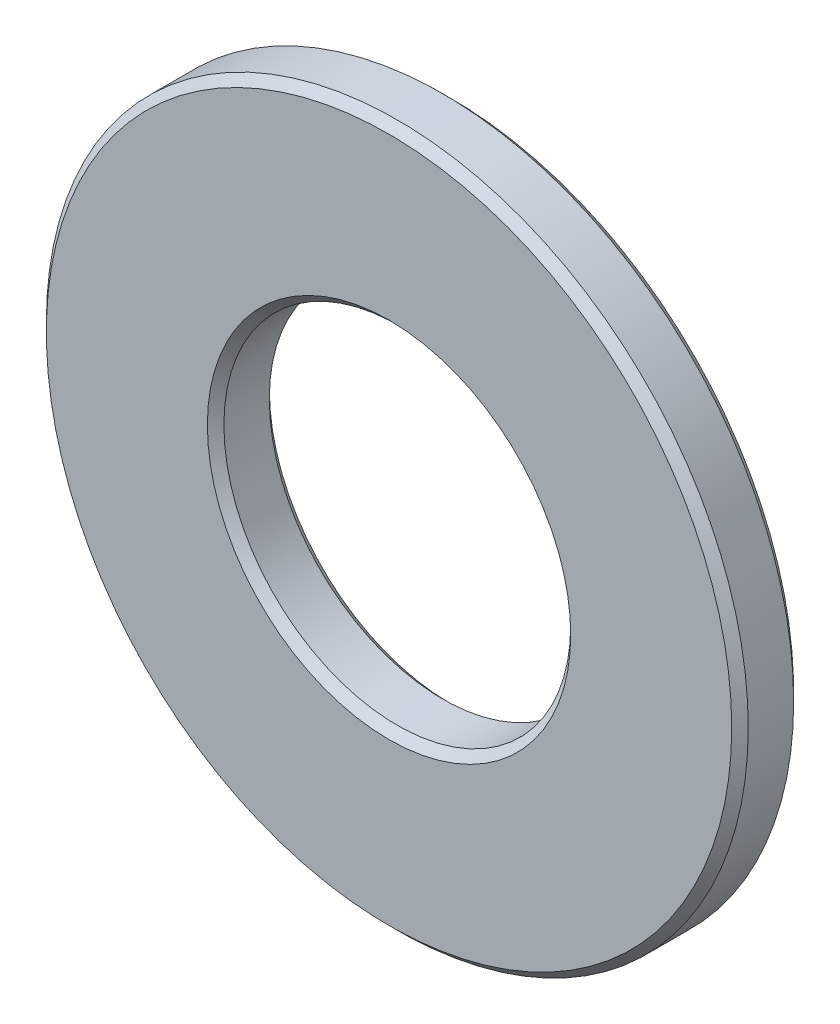
ISO-10303-21;
HEADER;
FILE_DESCRIPTION(('STEP AP214'),'2;1');
FILE_NAME('part.step','',(''),(''),'','','');
FILE_SCHEMA(('AUTOMOTIVE_DESIGN { 1 0 10303 214 1 1 1 1 }'));
ENDSEC;
DATA;
#1=APPLICATION_CONTEXT('core data for automotive mechanical design processes');
#2=APPLICATION_PROTOCOL_DEFINITION('international standard','automotive_design',2000,#1);
#3=PRODUCT_CONTEXT('',#1,'mechanical');
#4=PRODUCT('Part','Part','',(#3));
#5=PRODUCT_RELATED_PRODUCT_CATEGORY('part','',(#4));
#6=PRODUCT_DEFINITION_FORMATION('','',#4);
#7=PRODUCT_DEFINITION_CONTEXT('part definition',#1,'design');
#8=PRODUCT_DEFINITION('design','',#6,#7);
#9=PRODUCT_DEFINITION_SHAPE('','',#8);
#10=(LENGTH_UNIT() NAMED_UNIT(*) SI_UNIT(.MILLI.,.METRE.));
#11=(NAMED_UNIT(*) PLANE_ANGLE_UNIT() SI_UNIT($,.RADIAN.));
#12=(NAMED_UNIT(*) SI_UNIT($,.STERADIAN.) SOLID_ANGLE_UNIT());
#13=UNCERTAINTY_MEASURE_WITH_UNIT(LENGTH_MEASURE(1.E-05),#10,'distance_accuracy_value','');
#14=(GEOMETRIC_REPRESENTATION_CONTEXT(3) GLOBAL_UNCERTAINTY_ASSIGNED_CONTEXT((#13)) GLOBAL_UNIT_ASSIGNED_CONTEXT((#10,
#11,#12)) REPRESENTATION_CONTEXT('',''));
#15=CARTESIAN_POINT('',(0.,0.,0.));
#16=DIRECTION('',(0.,0.,1.));
#17=DIRECTION('',(1.,0.,0.));
#18=AXIS2_PLACEMENT_3D('',#15,#16,#17);
#19=CARTESIAN_POINT('',(0.,0.,0.));
#20=DIRECTION('',(0.,0.,1.));
#21=DIRECTION('',(1.,0.,0.));
#22=AXIS2_PLACEMENT_3D('',#19,#20,#21);
#23=CYLINDRICAL_SURFACE('',#22,4.2);
#24=CARTESIAN_POINT('',(0.,0.,-0.549999999999998));
#25=DIRECTION('',(0.,0.,-1.));
#26=DIRECTION('',(-1.,0.,0.));
#27=AXIS2_PLACEMENT_3D('',#24,#25,#26);
#28=CIRCLE('',#27,4.2);
#29=CARTESIAN_POINT('',(-4.2,0.,-0.549999999999998));
#30=VERTEX_POINT('',#29);
#31=EDGE_CURVE('E10',#30,#30,#28,.T.);
#32=ORIENTED_EDGE('',*,*,#31,.T.);
#33=EDGE_LOOP('',(#32));
#34=FACE_BOUND('',#33,.T.);
#35=CARTESIAN_POINT('',(0.,0.,0.549999999999999));
#36=DIRECTION('',(0.,0.,1.));
#37=DIRECTION('',(1.,0.,0.));
#38=AXIS2_PLACEMENT_3D('',#35,#36,#37);
#39=CIRCLE('',#38,4.2);
#40=CARTESIAN_POINT('',(4.2,0.,0.549999999999999));
#41=VERTEX_POINT('',#40);
#42=EDGE_CURVE('E38',#41,#41,#39,.T.);
#43=ORIENTED_EDGE('',*,*,#42,.T.);
#44=EDGE_LOOP('',(#43));
#45=FACE_BOUND('',#44,.T.);
#46=ADVANCED_FACE('F31',(#34,#45),#23,.F.);
#47=CARTESIAN_POINT('',(4.2,0.,0.75));
#48=DIRECTION('',(0.,0.,1.));
#49=DIRECTION('',(1.,0.,0.));
#50=AXIS2_PLACEMENT_3D('',#47,#48,#49);
#51=PLANE('',#50);
#52=CARTESIAN_POINT('',(0.,0.,0.75));
#53=DIRECTION('',(0.,0.,1.));
#54=DIRECTION('',(1.,0.,0.));
#55=AXIS2_PLACEMENT_3D('',#52,#53,#54);
#56=CIRCLE('',#55,8.3);
#57=CARTESIAN_POINT('',(8.3,0.,0.75));
#58=VERTEX_POINT('',#57);
#59=EDGE_CURVE('E57',#58,#58,#56,.T.);
#60=ORIENTED_EDGE('',*,*,#59,.T.);
#61=EDGE_LOOP('',(#60));
#62=FACE_BOUND('',#61,.T.);
#63=CARTESIAN_POINT('',(0.,0.,0.75));
#64=DIRECTION('',(0.,0.,1.));
#65=DIRECTION('',(1.,0.,0.));
#66=AXIS2_PLACEMENT_3D('',#63,#64,#65);
#67=CIRCLE('',#66,4.4);
#68=CARTESIAN_POINT('',(4.4,0.,0.75));
#69=VERTEX_POINT('',#68);
#70=EDGE_CURVE('E60',#69,#69,#67,.F.);
#71=ORIENTED_EDGE('',*,*,#70,.T.);
#72=EDGE_LOOP('',(#71));
#73=FACE_BOUND('',#72,.T.);
#74=ADVANCED_FACE('F64',(#62,#73),#51,.T.);
#75=CARTESIAN_POINT('',(0.,0.,0.));
#76=DIRECTION('',(0.,0.,1.));
#77=DIRECTION('',(1.,0.,0.));
#78=AXIS2_PLACEMENT_3D('',#75,#76,#77);
#79=CYLINDRICAL_SURFACE('',#78,8.5);
#80=CARTESIAN_POINT('',(0.,0.,0.550000000000003));
#81=DIRECTION('',(0.,0.,1.));
#82=DIRECTION('',(1.,0.,0.));
#83=AXIS2_PLACEMENT_3D('',#80,#81,#82);
#84=CIRCLE('',#83,8.5);
#85=CARTESIAN_POINT('',(8.5,0.,0.550000000000003));
#86=VERTEX_POINT('',#85);
#87=EDGE_CURVE('E51',#86,#86,#84,.F.);
#88=ORIENTED_EDGE('',*,*,#87,.T.);
#89=EDGE_LOOP('',(#88));
#90=FACE_BOUND('',#89,.T.);
#91=CARTESIAN_POINT('',(0.,0.,-0.549999999999998));
#92=DIRECTION('',(0.,0.,-1.));
#93=DIRECTION('',(-1.,0.,0.));
#94=AXIS2_PLACEMENT_3D('',#91,#92,#93);
#95=CIRCLE('',#94,8.5);
#96=CARTESIAN_POINT('',(-8.5,0.,-0.549999999999998));
#97=VERTEX_POINT('',#96);
#98=EDGE_CURVE('E54',#97,#97,#95,.F.);
#99=ORIENTED_EDGE('',*,*,#98,.T.);
#100=EDGE_LOOP('',(#99));
#101=FACE_BOUND('',#100,.T.);
#102=ADVANCED_FACE('F79',(#90,#101),#79,.T.);
#103=CARTESIAN_POINT('',(4.2,0.,-0.75));
#104=DIRECTION('',(0.,0.,-1.));
#105=DIRECTION('',(-1.,0.,0.));
#106=AXIS2_PLACEMENT_3D('',#103,#104,#105);
#107=PLANE('',#106);
#108=CARTESIAN_POINT('',(0.,0.,-0.75));
#109=DIRECTION('',(0.,0.,-1.));
#110=DIRECTION('',(-1.,0.,0.));
#111=AXIS2_PLACEMENT_3D('',#108,#109,#110);
#112=CIRCLE('',#111,8.3);
#113=CARTESIAN_POINT('',(-8.3,0.,-0.75));
#114=VERTEX_POINT('',#113);
#115=EDGE_CURVE('E42',#114,#114,#112,.T.);
#116=ORIENTED_EDGE('',*,*,#115,.T.);
#117=EDGE_LOOP('',(#116));
#118=FACE_BOUND('',#117,.T.);
#119=CARTESIAN_POINT('',(0.,0.,-0.75));
#120=DIRECTION('',(0.,0.,-1.));
#121=DIRECTION('',(-1.,0.,0.));
#122=AXIS2_PLACEMENT_3D('',#119,#120,#121);
#123=CIRCLE('',#122,4.4);
#124=CARTESIAN_POINT('',(-4.4,0.,-0.75));
#125=VERTEX_POINT('',#124);
#126=EDGE_CURVE('E46',#125,#125,#123,.F.);
#127=ORIENTED_EDGE('',*,*,#126,.T.);
#128=EDGE_LOOP('',(#127));
#129=FACE_BOUND('',#128,.T.);
#130=ADVANCED_FACE('F87',(#118,#129),#107,.T.);
#131=CARTESIAN_POINT('',(0.,0.,0.75));
#132=DIRECTION('',(0.,0.,-1.));
#133=DIRECTION('',(-1.,0.,0.));
#134=AXIS2_PLACEMENT_3D('',#131,#132,#133);
#135=CONICAL_SURFACE('',#134,8.3,0.785398163397453);
#136=ORIENTED_EDGE('',*,*,#87,.F.);
#137=EDGE_LOOP('',(#136));
#138=FACE_BOUND('',#137,.T.);
#139=ORIENTED_EDGE('',*,*,#59,.F.);
#140=EDGE_LOOP('',(#139));
#141=FACE_BOUND('',#140,.T.);
#142=ADVANCED_FACE('F84',(#138,#141),#135,.T.);
#143=CARTESIAN_POINT('',(0.,0.,-0.549999999999998));
#144=DIRECTION('',(0.,0.,1.));
#145=DIRECTION('',(1.,0.,0.));
#146=AXIS2_PLACEMENT_3D('',#143,#144,#145);
#147=CONICAL_SURFACE('',#146,8.5,0.785398163397444);
#148=ORIENTED_EDGE('',*,*,#115,.F.);
#149=EDGE_LOOP('',(#148));
#150=FACE_BOUND('',#149,.T.);
#151=ORIENTED_EDGE('',*,*,#98,.F.);
#152=EDGE_LOOP('',(#151));
#153=FACE_BOUND('',#152,.T.);
#154=ADVANCED_FACE('F72',(#150,#153),#147,.T.);
#155=CARTESIAN_POINT('',(0.,0.,-0.75));
#156=DIRECTION('',(0.,0.,-1.));
#157=DIRECTION('',(-1.,0.,0.));
#158=AXIS2_PLACEMENT_3D('',#155,#156,#157);
#159=CONICAL_SURFACE('',#158,4.4,0.785398163397448);
#160=ORIENTED_EDGE('',*,*,#31,.F.);
#161=EDGE_LOOP('',(#160));
#162=FACE_BOUND('',#161,.T.);
#163=ORIENTED_EDGE('',*,*,#126,.F.);
#164=EDGE_LOOP('',(#163));
#165=FACE_BOUND('',#164,.T.);
#166=ADVANCED_FACE('F68',(#162,#165),#159,.F.);
#167=CARTESIAN_POINT('',(0.,0.,0.549999999999999));
#168=DIRECTION('',(0.,0.,1.));
#169=DIRECTION('',(1.,0.,0.));
#170=AXIS2_PLACEMENT_3D('',#167,#168,#169);
#171=CONICAL_SURFACE('',#170,4.2,0.78539816339744);
#172=ORIENTED_EDGE('',*,*,#70,.F.);
#173=EDGE_LOOP('',(#172));
#174=FACE_BOUND('',#173,.T.);
#175=ORIENTED_EDGE('',*,*,#42,.F.);
#176=EDGE_LOOP('',(#175));
#177=FACE_BOUND('',#176,.T.);
#178=ADVANCED_FACE('F33',(#174,#177),#171,.F.);
#179=CLOSED_SHELL('',(#46,#74,#102,#130,#142,#154,#166,#178));
#180=MANIFOLD_SOLID_BREP('B2',#179);
#181=ADVANCED_BREP_SHAPE_REPRESENTATION('',(#18,#180),#14);
#182=SHAPE_DEFINITION_REPRESENTATION(#9,#181);
ENDSEC;
END-ISO-10303-21;
